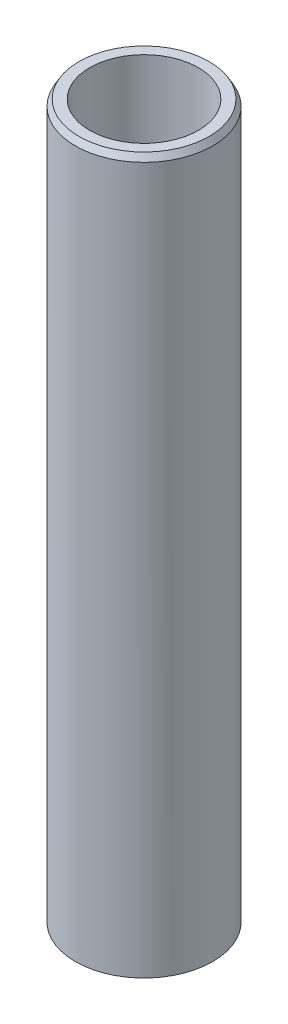
ISO-10303-21;
HEADER;
FILE_DESCRIPTION(('STEP AP214'),'2;1');
FILE_NAME('part.step','',(''),(''),'','','');
FILE_SCHEMA(('AUTOMOTIVE_DESIGN { 1 0 10303 214 1 1 1 1 }'));
ENDSEC;
DATA;
#1=APPLICATION_CONTEXT('core data for automotive mechanical design processes');
#2=APPLICATION_PROTOCOL_DEFINITION('international standard','automotive_design',2000,#1);
#3=PRODUCT_CONTEXT('',#1,'mechanical');
#4=PRODUCT('Part','Part','',(#3));
#5=PRODUCT_RELATED_PRODUCT_CATEGORY('part','',(#4));
#6=PRODUCT_DEFINITION_FORMATION('','',#4);
#7=PRODUCT_DEFINITION_CONTEXT('part definition',#1,'design');
#8=PRODUCT_DEFINITION('design','',#6,#7);
#9=PRODUCT_DEFINITION_SHAPE('','',#8);
#10=(LENGTH_UNIT() NAMED_UNIT(*) SI_UNIT(.MILLI.,.METRE.));
#11=(NAMED_UNIT(*) PLANE_ANGLE_UNIT() SI_UNIT($,.RADIAN.));
#12=(NAMED_UNIT(*) SI_UNIT($,.STERADIAN.) SOLID_ANGLE_UNIT());
#13=UNCERTAINTY_MEASURE_WITH_UNIT(LENGTH_MEASURE(1.E-05),#10,'distance_accuracy_value','');
#14=(GEOMETRIC_REPRESENTATION_CONTEXT(3) GLOBAL_UNCERTAINTY_ASSIGNED_CONTEXT((#13)) GLOBAL_UNIT_ASSIGNED_CONTEXT((#10,
#11,#12)) REPRESENTATION_CONTEXT('',''));
#15=CARTESIAN_POINT('',(0.,0.,0.));
#16=DIRECTION('',(0.,0.,1.));
#17=DIRECTION('',(1.,0.,0.));
#18=AXIS2_PLACEMENT_3D('',#15,#16,#17);
#19=CARTESIAN_POINT('',(0.,600.,0.));
#20=DIRECTION('',(0.,-1.,0.));
#21=DIRECTION('',(0.,0.,-1.));
#22=AXIS2_PLACEMENT_3D('',#19,#20,#21);
#23=CYLINDRICAL_SURFACE('',#22,57.5);
#24=CARTESIAN_POINT('',(0.,594.686407557378,0.));
#25=DIRECTION('',(0.,1.,0.));
#26=DIRECTION('',(0.,0.,1.));
#27=AXIS2_PLACEMENT_3D('',#24,#25,#26);
#28=CIRCLE('',#27,57.5);
#29=CARTESIAN_POINT('',(0.,594.686407557378,-57.5));
#30=VERTEX_POINT('',#29);
#31=EDGE_CURVE('E50',#30,#30,#28,.F.);
#32=ORIENTED_EDGE('',*,*,#31,.T.);
#33=EDGE_LOOP('',(#32));
#34=FACE_BOUND('',#33,.T.);
#35=CARTESIAN_POINT('',(0.,3.06780402711193,0.));
#36=DIRECTION('',(0.,1.,0.));
#37=DIRECTION('',(0.,0.,1.));
#38=AXIS2_PLACEMENT_3D('',#35,#36,#37);
#39=CIRCLE('',#38,57.5);
#40=CARTESIAN_POINT('',(0.,3.06780402711193,57.5));
#41=VERTEX_POINT('',#40);
#42=EDGE_CURVE('E51',#41,#41,#39,.T.);
#43=ORIENTED_EDGE('',*,*,#42,.T.);
#44=EDGE_LOOP('',(#43));
#45=FACE_BOUND('',#44,.T.);
#46=ADVANCED_FACE('F39',(#34,#45),#23,.T.);
#47=CARTESIAN_POINT('',(0.,600.,0.));
#48=DIRECTION('',(0.,1.,0.));
#49=DIRECTION('',(0.,0.,1.));
#50=AXIS2_PLACEMENT_3D('',#47,#48,#49);
#51=PLANE('',#50);
#52=CARTESIAN_POINT('',(0.,600.,0.));
#53=DIRECTION('',(0.,1.,0.));
#54=DIRECTION('',(0.,0.,1.));
#55=AXIS2_PLACEMENT_3D('',#52,#53,#54);
#56=CIRCLE('',#55,54.4321959728881);
#57=CARTESIAN_POINT('',(0.,600.,-54.4321959728882));
#58=VERTEX_POINT('',#57);
#59=EDGE_CURVE('E54',#58,#58,#56,.T.);
#60=ORIENTED_EDGE('',*,*,#59,.T.);
#61=EDGE_LOOP('',(#60));
#62=FACE_BOUND('',#61,.T.);
#63=CARTESIAN_POINT('',(0.,600.,0.));
#64=DIRECTION('',(0.,1.,0.));
#65=DIRECTION('',(0.,0.,1.));
#66=AXIS2_PLACEMENT_3D('',#63,#64,#65);
#67=CIRCLE('',#66,45.5175706563952);
#68=CARTESIAN_POINT('',(0.,600.,45.5175706563952));
#69=VERTEX_POINT('',#68);
#70=EDGE_CURVE('E58',#69,#69,#67,.T.);
#71=ORIENTED_EDGE('',*,*,#70,.F.);
#72=EDGE_LOOP('',(#71));
#73=FACE_BOUND('',#72,.T.);
#74=ADVANCED_FACE('F69',(#62,#73),#51,.T.);
#75=CARTESIAN_POINT('',(0.,0.,0.));
#76=DIRECTION('',(0.,1.,0.));
#77=DIRECTION('',(0.,0.,1.));
#78=AXIS2_PLACEMENT_3D('',#75,#76,#77);
#79=PLANE('',#78);
#80=CARTESIAN_POINT('',(0.,0.,0.));
#81=DIRECTION('',(0.,1.,0.));
#82=DIRECTION('',(0.,0.,1.));
#83=AXIS2_PLACEMENT_3D('',#80,#81,#82);
#84=CIRCLE('',#83,52.1864075573777);
#85=CARTESIAN_POINT('',(0.,0.,52.1864075573777));
#86=VERTEX_POINT('',#85);
#87=EDGE_CURVE('E10',#86,#86,#84,.F.);
#88=ORIENTED_EDGE('',*,*,#87,.T.);
#89=EDGE_LOOP('',(#88));
#90=FACE_BOUND('',#89,.T.);
#91=CARTESIAN_POINT('',(0.,0.,0.));
#92=DIRECTION('',(0.,1.,0.));
#93=DIRECTION('',(0.,0.,1.));
#94=AXIS2_PLACEMENT_3D('',#91,#92,#93);
#95=CIRCLE('',#94,45.5175706563952);
#96=CARTESIAN_POINT('',(0.,0.,45.5175706563952));
#97=VERTEX_POINT('',#96);
#98=EDGE_CURVE('E63',#97,#97,#95,.T.);
#99=ORIENTED_EDGE('',*,*,#98,.T.);
#100=EDGE_LOOP('',(#99));
#101=FACE_BOUND('',#100,.T.);
#102=ADVANCED_FACE('F75',(#90,#101),#79,.F.);
#103=CARTESIAN_POINT('',(0.,600.,0.));
#104=DIRECTION('',(0.,-1.,0.));
#105=DIRECTION('',(0.,0.,-1.));
#106=AXIS2_PLACEMENT_3D('',#103,#104,#105);
#107=CYLINDRICAL_SURFACE('',#106,45.5175706563952);
#108=ORIENTED_EDGE('',*,*,#70,.T.);
#109=EDGE_LOOP('',(#108));
#110=FACE_BOUND('',#109,.T.);
#111=ORIENTED_EDGE('',*,*,#98,.F.);
#112=EDGE_LOOP('',(#111));
#113=FACE_BOUND('',#112,.T.);
#114=ADVANCED_FACE('F70',(#110,#113),#107,.F.);
#115=CARTESIAN_POINT('',(0.,600.,0.));
#116=DIRECTION('',(0.,-1.,0.));
#117=DIRECTION('',(0.,0.,-1.));
#118=AXIS2_PLACEMENT_3D('',#115,#116,#117);
#119=CONICAL_SURFACE('',#118,54.4321959728881,0.523598775598298);
#120=CARTESIAN_POINT('',(0.,594.686407557378,-57.5));
#121=CARTESIAN_POINT('',(0.,594.741757478655,-57.468043708051));
#122=CARTESIAN_POINT('',(0.,594.797107399932,-57.4360874161019));
#123=CARTESIAN_POINT('',(0.,594.907807242487,-57.3721748322037));
#124=CARTESIAN_POINT('',(0.,594.963157163764,-57.3402185402546));
#125=CARTESIAN_POINT('',(0.,595.073857006319,-57.2763059563565));
#126=CARTESIAN_POINT('',(0.,595.129206927596,-57.2443496644074));
#127=CARTESIAN_POINT('',(0.,595.239906770151,-57.1804370805092));
#128=CARTESIAN_POINT('',(0.,595.295256691428,-57.1484807885601));
#129=CARTESIAN_POINT('',(0.,595.405956533983,-57.084568204662));
#130=CARTESIAN_POINT('',(0.,595.46130645526,-57.0526119127129));
#131=CARTESIAN_POINT('',(0.,595.572006297815,-56.9886993288147));
#132=CARTESIAN_POINT('',(0.,595.627356219092,-56.9567430368656));
#133=CARTESIAN_POINT('',(0.,595.738056061647,-56.8928304529675));
#134=CARTESIAN_POINT('',(0.,595.793405982924,-56.8608741610184));
#135=CARTESIAN_POINT('',(0.,595.904105825479,-56.7969615771202));
#136=CARTESIAN_POINT('',(0.,595.959455746756,-56.7650052851711));
#137=CARTESIAN_POINT('',(0.,596.070155589311,-56.701092701273));
#138=CARTESIAN_POINT('',(0.,596.125505510588,-56.6691364093239));
#139=CARTESIAN_POINT('',(0.,596.236205353143,-56.6052238254257));
#140=CARTESIAN_POINT('',(0.,596.29155527442,-56.5732675334767));
#141=CARTESIAN_POINT('',(0.,596.402255116975,-56.5093549495785));
#142=CARTESIAN_POINT('',(0.,596.457605038252,-56.4773986576294));
#143=CARTESIAN_POINT('',(0.,596.568304880807,-56.4134860737312));
#144=CARTESIAN_POINT('',(0.,596.623654802084,-56.3815297817822));
#145=CARTESIAN_POINT('',(0.,596.734354644638,-56.317617197884));
#146=CARTESIAN_POINT('',(0.,596.789704565916,-56.2856609059349));
#147=CARTESIAN_POINT('',(0.,596.90040440847,-56.2217483220367));
#148=CARTESIAN_POINT('',(0.,596.955754329748,-56.1897920300877));
#149=CARTESIAN_POINT('',(0.,597.066454172302,-56.1258794461895));
#150=CARTESIAN_POINT('',(0.,597.12180409358,-56.0939231542404));
#151=CARTESIAN_POINT('',(0.,597.232503936134,-56.0300105703423));
#152=CARTESIAN_POINT('',(0.,597.287853857412,-55.9980542783932));
#153=CARTESIAN_POINT('',(0.,597.398553699966,-55.934141694495));
#154=CARTESIAN_POINT('',(0.,597.453903621244,-55.9021854025459));
#155=CARTESIAN_POINT('',(0.,597.564603463798,-55.8382728186478));
#156=CARTESIAN_POINT('',(0.,597.619953385075,-55.8063165266987));
#157=CARTESIAN_POINT('',(0.,597.73065322763,-55.7424039428005));
#158=CARTESIAN_POINT('',(0.,597.786003148907,-55.7104476508514));
#159=CARTESIAN_POINT('',(0.,597.896702991462,-55.6465350669533));
#160=CARTESIAN_POINT('',(0.,597.952052912739,-55.6145787750042));
#161=CARTESIAN_POINT('',(0.,598.062752755294,-55.550666191106));
#162=CARTESIAN_POINT('',(0.,598.118102676571,-55.5187098991569));
#163=CARTESIAN_POINT('',(0.,598.228802519126,-55.4547973152588));
#164=CARTESIAN_POINT('',(0.,598.284152440403,-55.4228410233097));
#165=CARTESIAN_POINT('',(0.,598.394852282958,-55.3589284394115));
#166=CARTESIAN_POINT('',(0.,598.450202204235,-55.3269721474625));
#167=CARTESIAN_POINT('',(0.,598.56090204679,-55.2630595635643));
#168=CARTESIAN_POINT('',(0.,598.616251968067,-55.2311032716152));
#169=CARTESIAN_POINT('',(0.,598.726951810622,-55.167190687717));
#170=CARTESIAN_POINT('',(0.,598.782301731899,-55.135234395768));
#171=CARTESIAN_POINT('',(0.,598.893001574454,-55.0713218118698));
#172=CARTESIAN_POINT('',(0.,598.948351495731,-55.0393655199207));
#173=CARTESIAN_POINT('',(0.,599.059051338286,-54.9754529360225));
#174=CARTESIAN_POINT('',(0.,599.114401259563,-54.9434966440735));
#175=CARTESIAN_POINT('',(0.,599.225101102118,-54.8795840601753));
#176=CARTESIAN_POINT('',(0.,599.280451023395,-54.8476277682262));
#177=CARTESIAN_POINT('',(0.,599.391150865949,-54.7837151843281));
#178=CARTESIAN_POINT('',(0.,599.446500787227,-54.751758892379));
#179=CARTESIAN_POINT('',(0.,599.557200629782,-54.6878463084808));
#180=CARTESIAN_POINT('',(0.,599.612550551059,-54.6558900165317));
#181=CARTESIAN_POINT('',(0.,599.723250393613,-54.5919774326336));
#182=CARTESIAN_POINT('',(0.,599.778600314891,-54.5600211406845));
#183=CARTESIAN_POINT('',(0.,599.889300157445,-54.4961085567863));
#184=CARTESIAN_POINT('',(0.,599.944650078723,-54.4641522648372));
#185=CARTESIAN_POINT('',(0.,600.,-54.4321959728882));
#186=B_SPLINE_CURVE_WITH_KNOTS('',3,(#120,#121,#122,#123,#124,#125,#126,#127,#128,#129,#130,
#131,#132,#133,#134,#135,#136,#137,#138,#139,#140,#141,#142,#143,#144,#145,#146,#147,#148,#149,
#150,#151,#152,#153,#154,#155,#156,#157,#158,#159,#160,#161,#162,#163,#164,#165,#166,#167,#168,
#169,#170,#171,#172,#173,#174,#175,#176,#177,#178,#179,#180,#181,#182,#183,#184,#185),
.UNSPECIFIED.,.F.,.F.,(4,2,2,2,2,2,2,2,2,2,2,2,2,2,2,2,2,2,2,2,2,2,2,2,2,2,2,2,2,2,2,2,4),(0.,
0.191737751694494,0.383475503388987,0.575213255083481,0.766951006777974,0.958688758472464,
1.15042651016696,1.34216426186145,1.53390201355594,1.72563976525043,1.91737751694493,
2.10911526863942,2.30085302033392,2.49259077202841,2.6843285237229,2.87606627541739,
3.06780402711189,3.25954177880638,3.45127953050087,3.64301728219536,3.83475503388986,
4.02649278558435,4.21823053727884,4.40996828897334,4.60170604066783,4.79344379236232,
4.98518154405682,5.17691929575131,5.3686570474458,5.5603947991403,5.75213255083479,
5.94387030252928,6.13560805422377),.UNSPECIFIED.);
#187=EDGE_CURVE('BSEAM81',#30,#58,#186,.T.);
#188=ORIENTED_EDGE('',*,*,#31,.F.);
#189=ORIENTED_EDGE('',*,*,#59,.F.);
#190=ORIENTED_EDGE('',*,*,#187,.T.);
#191=ORIENTED_EDGE('',*,*,#187,.F.);
#192=EDGE_LOOP('',(#188,#190,#189,#191));
#193=FACE_BOUND('',#192,.T.);
#194=ADVANCED_FACE('F81',(#193),#119,.T.);
#195=CARTESIAN_POINT('',(0.,3.06780402711193,0.));
#196=DIRECTION('',(0.,1.,0.));
#197=DIRECTION('',(0.,0.,1.));
#198=AXIS2_PLACEMENT_3D('',#195,#196,#197);
#199=CONICAL_SURFACE('',#198,57.5,1.0471975511966);
#200=ORIENTED_EDGE('',*,*,#87,.F.);
#201=EDGE_LOOP('',(#200));
#202=FACE_BOUND('',#201,.T.);
#203=ORIENTED_EDGE('',*,*,#42,.F.);
#204=EDGE_LOOP('',(#203));
#205=FACE_BOUND('',#204,.T.);
#206=ADVANCED_FACE('F45',(#202,#205),#199,.T.);
#207=CLOSED_SHELL('',(#46,#74,#102,#114,#194,#206));
#208=MANIFOLD_SOLID_BREP('B2',#207);
#209=ADVANCED_BREP_SHAPE_REPRESENTATION('',(#18,#208),#14);
#210=SHAPE_DEFINITION_REPRESENTATION(#9,#209);
ENDSEC;
END-ISO-10303-21;
